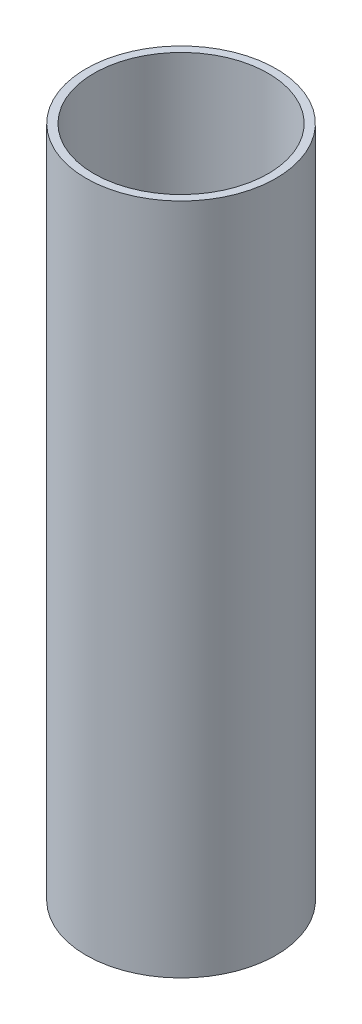
ISO-10303-21;
HEADER;
FILE_DESCRIPTION(('STEP AP214'),'2;1');
FILE_NAME('part.step','',(''),(''),'','','');
FILE_SCHEMA(('AUTOMOTIVE_DESIGN { 1 0 10303 214 1 1 1 1 }'));
ENDSEC;
DATA;
#1=APPLICATION_CONTEXT('core data for automotive mechanical design processes');
#2=APPLICATION_PROTOCOL_DEFINITION('international standard','automotive_design',2000,#1);
#3=PRODUCT_CONTEXT('',#1,'mechanical');
#4=PRODUCT('Part','Part','',(#3));
#5=PRODUCT_RELATED_PRODUCT_CATEGORY('part','',(#4));
#6=PRODUCT_DEFINITION_FORMATION('','',#4);
#7=PRODUCT_DEFINITION_CONTEXT('part definition',#1,'design');
#8=PRODUCT_DEFINITION('design','',#6,#7);
#9=PRODUCT_DEFINITION_SHAPE('','',#8);
#10=(LENGTH_UNIT() NAMED_UNIT(*) SI_UNIT(.MILLI.,.METRE.));
#11=(NAMED_UNIT(*) PLANE_ANGLE_UNIT() SI_UNIT($,.RADIAN.));
#12=(NAMED_UNIT(*) SI_UNIT($,.STERADIAN.) SOLID_ANGLE_UNIT());
#13=UNCERTAINTY_MEASURE_WITH_UNIT(LENGTH_MEASURE(1.E-05),#10,'distance_accuracy_value','');
#14=(GEOMETRIC_REPRESENTATION_CONTEXT(3) GLOBAL_UNCERTAINTY_ASSIGNED_CONTEXT((#13)) GLOBAL_UNIT_ASSIGNED_CONTEXT((#10,
#11,#12)) REPRESENTATION_CONTEXT('',''));
#15=CARTESIAN_POINT('',(0.,0.,0.));
#16=DIRECTION('',(0.,0.,1.));
#17=DIRECTION('',(1.,0.,0.));
#18=AXIS2_PLACEMENT_3D('',#15,#16,#17);
#19=CARTESIAN_POINT('',(0.,85.,0.));
#20=DIRECTION('',(0.,1.,0.));
#21=DIRECTION('',(0.,0.,1.));
#22=AXIS2_PLACEMENT_3D('',#19,#20,#21);
#23=PLANE('',#22);
#24=CARTESIAN_POINT('',(0.,85.,0.));
#25=DIRECTION('',(0.,1.,0.));
#26=DIRECTION('',(0.,0.,1.));
#27=AXIS2_PLACEMENT_3D('',#24,#25,#26);
#28=CIRCLE('',#27,12.);
#29=CARTESIAN_POINT('',(0.,85.,12.));
#30=VERTEX_POINT('',#29);
#31=EDGE_CURVE('E10',#30,#30,#28,.T.);
#32=ORIENTED_EDGE('',*,*,#31,.T.);
#33=EDGE_LOOP('',(#32));
#34=FACE_BOUND('',#33,.T.);
#35=CARTESIAN_POINT('',(0.,85.,0.));
#36=DIRECTION('',(0.,1.,0.));
#37=DIRECTION('',(0.,0.,1.));
#38=AXIS2_PLACEMENT_3D('',#35,#36,#37);
#39=CIRCLE('',#38,11.);
#40=CARTESIAN_POINT('',(0.,85.,11.));
#41=VERTEX_POINT('',#40);
#42=EDGE_CURVE('E44',#41,#41,#39,.T.);
#43=ORIENTED_EDGE('',*,*,#42,.F.);
#44=EDGE_LOOP('',(#43));
#45=FACE_BOUND('',#44,.T.);
#46=ADVANCED_FACE('F33',(#34,#45),#23,.T.);
#47=CARTESIAN_POINT('',(0.,0.,0.));
#48=DIRECTION('',(0.,1.,0.));
#49=DIRECTION('',(0.,0.,1.));
#50=AXIS2_PLACEMENT_3D('',#47,#48,#49);
#51=PLANE('',#50);
#52=CARTESIAN_POINT('',(0.,0.,0.));
#53=DIRECTION('',(0.,1.,0.));
#54=DIRECTION('',(0.,0.,1.));
#55=AXIS2_PLACEMENT_3D('',#52,#53,#54);
#56=CIRCLE('',#55,12.);
#57=CARTESIAN_POINT('',(0.,0.,12.));
#58=VERTEX_POINT('',#57);
#59=EDGE_CURVE('E37',#58,#58,#56,.T.);
#60=ORIENTED_EDGE('',*,*,#59,.F.);
#61=EDGE_LOOP('',(#60));
#62=FACE_BOUND('',#61,.T.);
#63=CARTESIAN_POINT('',(0.,0.,0.));
#64=DIRECTION('',(0.,1.,0.));
#65=DIRECTION('',(0.,0.,1.));
#66=AXIS2_PLACEMENT_3D('',#63,#64,#65);
#67=CIRCLE('',#66,11.);
#68=CARTESIAN_POINT('',(0.,0.,11.));
#69=VERTEX_POINT('',#68);
#70=EDGE_CURVE('E46',#69,#69,#67,.T.);
#71=ORIENTED_EDGE('',*,*,#70,.T.);
#72=EDGE_LOOP('',(#71));
#73=FACE_BOUND('',#72,.T.);
#74=ADVANCED_FACE('F56',(#62,#73),#51,.F.);
#75=CARTESIAN_POINT('',(0.,85.,0.));
#76=DIRECTION('',(0.,-1.,0.));
#77=DIRECTION('',(0.,0.,-1.));
#78=AXIS2_PLACEMENT_3D('',#75,#76,#77);
#79=CYLINDRICAL_SURFACE('',#78,12.);
#80=ORIENTED_EDGE('',*,*,#31,.F.);
#81=EDGE_LOOP('',(#80));
#82=FACE_BOUND('',#81,.T.);
#83=ORIENTED_EDGE('',*,*,#59,.T.);
#84=EDGE_LOOP('',(#83));
#85=FACE_BOUND('',#84,.T.);
#86=ADVANCED_FACE('F35',(#82,#85),#79,.T.);
#87=CARTESIAN_POINT('',(0.,85.,0.));
#88=DIRECTION('',(0.,-1.,0.));
#89=DIRECTION('',(0.,0.,-1.));
#90=AXIS2_PLACEMENT_3D('',#87,#88,#89);
#91=CYLINDRICAL_SURFACE('',#90,11.);
#92=ORIENTED_EDGE('',*,*,#42,.T.);
#93=EDGE_LOOP('',(#92));
#94=FACE_BOUND('',#93,.T.);
#95=ORIENTED_EDGE('',*,*,#70,.F.);
#96=EDGE_LOOP('',(#95));
#97=FACE_BOUND('',#96,.T.);
#98=ADVANCED_FACE('F52',(#94,#97),#91,.F.);
#99=CLOSED_SHELL('',(#46,#74,#86,#98));
#100=MANIFOLD_SOLID_BREP('B2',#99);
#101=ADVANCED_BREP_SHAPE_REPRESENTATION('',(#18,#100),#14);
#102=SHAPE_DEFINITION_REPRESENTATION(#9,#101);
ENDSEC;
END-ISO-10303-21;
